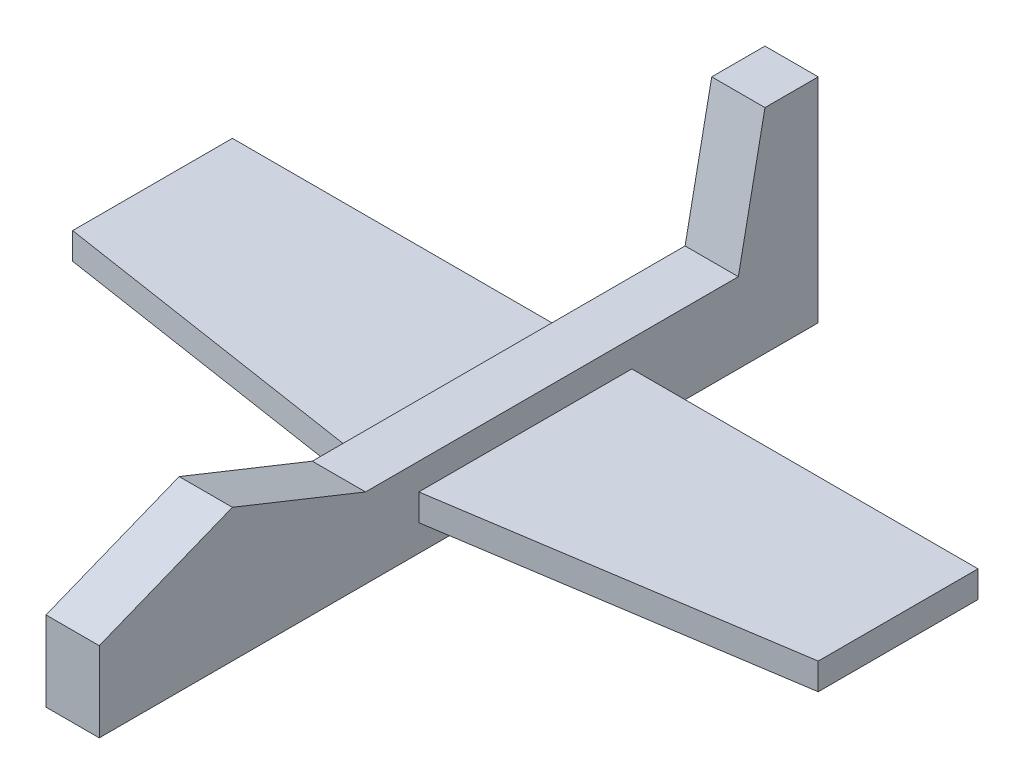
ISO-10303-21;
HEADER;
FILE_DESCRIPTION(('STEP AP214'),'2;1');
FILE_NAME('part.step','',(''),(''),'','','');
FILE_SCHEMA(('AUTOMOTIVE_DESIGN { 1 0 10303 214 1 1 1 1 }'));
ENDSEC;
DATA;
#1=APPLICATION_CONTEXT('core data for automotive mechanical design processes');
#2=APPLICATION_PROTOCOL_DEFINITION('international standard','automotive_design',2000,#1);
#3=PRODUCT_CONTEXT('',#1,'mechanical');
#4=PRODUCT('Part','Part','',(#3));
#5=PRODUCT_RELATED_PRODUCT_CATEGORY('part','',(#4));
#6=PRODUCT_DEFINITION_FORMATION('','',#4);
#7=PRODUCT_DEFINITION_CONTEXT('part definition',#1,'design');
#8=PRODUCT_DEFINITION('design','',#6,#7);
#9=PRODUCT_DEFINITION_SHAPE('','',#8);
#10=(LENGTH_UNIT() NAMED_UNIT(*) SI_UNIT(.MILLI.,.METRE.));
#11=(NAMED_UNIT(*) PLANE_ANGLE_UNIT() SI_UNIT($,.RADIAN.));
#12=(NAMED_UNIT(*) SI_UNIT($,.STERADIAN.) SOLID_ANGLE_UNIT());
#13=UNCERTAINTY_MEASURE_WITH_UNIT(LENGTH_MEASURE(1.E-05),#10,'distance_accuracy_value','');
#14=(GEOMETRIC_REPRESENTATION_CONTEXT(3) GLOBAL_UNCERTAINTY_ASSIGNED_CONTEXT((#13)) GLOBAL_UNIT_ASSIGNED_CONTEXT((#10,
#11,#12)) REPRESENTATION_CONTEXT('',''));
#15=CARTESIAN_POINT('',(0.,0.,0.));
#16=DIRECTION('',(0.,0.,1.));
#17=DIRECTION('',(1.,0.,0.));
#18=AXIS2_PLACEMENT_3D('',#15,#16,#17);
#19=CARTESIAN_POINT('',(-5.,0.,0.));
#20=DIRECTION('',(-1.,0.,0.));
#21=DIRECTION('',(0.,0.,1.));
#22=AXIS2_PLACEMENT_3D('',#19,#20,#21);
#23=PLANE('',#22);
#24=DIRECTION('',(0.,1.,0.));
#25=VECTOR('',#24,1.);
#26=CARTESIAN_POINT('',(-5.,0.,0.));
#27=LINE('',#26,#25);
#28=CARTESIAN_POINT('',(-5.,0.,0.));
#29=VERTEX_POINT('',#28);
#30=CARTESIAN_POINT('',(-5.,15.,0.));
#31=VERTEX_POINT('',#30);
#32=EDGE_CURVE('E236',#29,#31,#27,.T.);
#33=ORIENTED_EDGE('',*,*,#32,.T.);
#34=DIRECTION('',(0.,0.371390676354104,-0.928476690885259));
#35=VECTOR('',#34,1.);
#36=CARTESIAN_POINT('',(-5.,15.,0.));
#37=LINE('',#36,#35);
#38=CARTESIAN_POINT('',(-5.,25.,-25.));
#39=VERTEX_POINT('',#38);
#40=EDGE_CURVE('E239',#31,#39,#37,.T.);
#41=ORIENTED_EDGE('',*,*,#40,.T.);
#42=DIRECTION('',(0.,-0.371390676354104,-0.928476690885259));
#43=VECTOR('',#42,1.);
#44=CARTESIAN_POINT('',(-5.,25.,-25.));
#45=LINE('',#44,#43);
#46=CARTESIAN_POINT('',(-5.,15.,-50.));
#47=VERTEX_POINT('',#46);
#48=EDGE_CURVE('E241',#39,#47,#45,.T.);
#49=ORIENTED_EDGE('',*,*,#48,.T.);
#50=DIRECTION('',(0.,0.,-1.));
#51=VECTOR('',#50,1.);
#52=CARTESIAN_POINT('',(-5.,15.,-50.));
#53=LINE('',#52,#51);
#54=CARTESIAN_POINT('',(-5.,15.,-120.));
#55=VERTEX_POINT('',#54);
#56=EDGE_CURVE('E243',#47,#55,#53,.T.);
#57=ORIENTED_EDGE('',*,*,#56,.T.);
#58=DIRECTION('',(0.,0.98058067569092,-0.196116135138184));
#59=VECTOR('',#58,1.);
#60=CARTESIAN_POINT('',(-5.,15.,-120.));
#61=LINE('',#60,#59);
#62=CARTESIAN_POINT('',(-5.,40.,-125.));
#63=VERTEX_POINT('',#62);
#64=EDGE_CURVE('E245',#55,#63,#61,.T.);
#65=ORIENTED_EDGE('',*,*,#64,.T.);
#66=DIRECTION('',(0.,0.,-1.));
#67=VECTOR('',#66,1.);
#68=CARTESIAN_POINT('',(-5.,40.,-125.));
#69=LINE('',#68,#67);
#70=CARTESIAN_POINT('',(-5.,40.,-135.));
#71=VERTEX_POINT('',#70);
#72=EDGE_CURVE('E247',#63,#71,#69,.T.);
#73=ORIENTED_EDGE('',*,*,#72,.T.);
#74=DIRECTION('',(0.,-1.,0.));
#75=VECTOR('',#74,1.);
#76=CARTESIAN_POINT('',(-5.,40.,-135.));
#77=LINE('',#76,#75);
#78=CARTESIAN_POINT('',(-5.,0.,-135.));
#79=VERTEX_POINT('',#78);
#80=EDGE_CURVE('E249',#71,#79,#77,.T.);
#81=ORIENTED_EDGE('',*,*,#80,.T.);
#82=DIRECTION('',(0.,0.,1.));
#83=VECTOR('',#82,1.);
#84=CARTESIAN_POINT('',(-5.,0.,-135.));
#85=LINE('',#84,#83);
#86=EDGE_CURVE('E251',#79,#29,#85,.T.);
#87=ORIENTED_EDGE('',*,*,#86,.T.);
#88=EDGE_LOOP('',(#33,#41,#49,#57,#65,#73,#81,#87));
#89=FACE_BOUND('',#88,.T.);
#90=DIRECTION('',(0.,-1.,0.));
#91=VECTOR('',#90,1.);
#92=CARTESIAN_POINT('',(-5.,10.,-100.));
#93=LINE('',#92,#91);
#94=CARTESIAN_POINT('',(-5.,10.,-100.));
#95=VERTEX_POINT('',#94);
#96=CARTESIAN_POINT('',(-5.,5.,-100.));
#97=VERTEX_POINT('',#96);
#98=EDGE_CURVE('E50',#95,#97,#93,.T.);
#99=ORIENTED_EDGE('',*,*,#98,.F.);
#100=DIRECTION('',(0.,0.,1.));
#101=VECTOR('',#100,1.);
#102=CARTESIAN_POINT('',(-5.,10.,-100.));
#103=LINE('',#102,#101);
#104=CARTESIAN_POINT('',(-5.,10.,-60.));
#105=VERTEX_POINT('',#104);
#106=EDGE_CURVE('E54',#95,#105,#103,.T.);
#107=ORIENTED_EDGE('',*,*,#106,.T.);
#108=DIRECTION('',(0.,-1.,0.));
#109=VECTOR('',#108,1.);
#110=CARTESIAN_POINT('',(-5.,10.,-60.));
#111=LINE('',#110,#109);
#112=CARTESIAN_POINT('',(-5.,5.,-60.));
#113=VERTEX_POINT('',#112);
#114=EDGE_CURVE('E167',#105,#113,#111,.T.);
#115=ORIENTED_EDGE('',*,*,#114,.T.);
#116=DIRECTION('',(0.,0.,1.));
#117=VECTOR('',#116,1.);
#118=CARTESIAN_POINT('',(-5.,5.,-100.));
#119=LINE('',#118,#117);
#120=EDGE_CURVE('E171',#97,#113,#119,.T.);
#121=ORIENTED_EDGE('',*,*,#120,.F.);
#122=EDGE_LOOP('',(#99,#107,#115,#121));
#123=FACE_BOUND('',#122,.T.);
#124=ADVANCED_FACE('F35',(#89,#123),#23,.T.);
#125=CARTESIAN_POINT('',(5.,0.,0.));
#126=DIRECTION('',(-1.,0.,0.));
#127=DIRECTION('',(0.,0.,1.));
#128=AXIS2_PLACEMENT_3D('',#125,#126,#127);
#129=PLANE('',#128);
#130=DIRECTION('',(0.,1.,0.));
#131=VECTOR('',#130,1.);
#132=CARTESIAN_POINT('',(5.,0.,0.));
#133=LINE('',#132,#131);
#134=CARTESIAN_POINT('',(5.,0.,0.));
#135=VERTEX_POINT('',#134);
#136=CARTESIAN_POINT('',(5.,15.,0.));
#137=VERTEX_POINT('',#136);
#138=EDGE_CURVE('E212',#135,#137,#133,.T.);
#139=ORIENTED_EDGE('',*,*,#138,.F.);
#140=DIRECTION('',(0.,0.,1.));
#141=VECTOR('',#140,1.);
#142=CARTESIAN_POINT('',(5.,0.,-135.));
#143=LINE('',#142,#141);
#144=CARTESIAN_POINT('',(5.,0.,-135.));
#145=VERTEX_POINT('',#144);
#146=EDGE_CURVE('E233',#145,#135,#143,.T.);
#147=ORIENTED_EDGE('',*,*,#146,.F.);
#148=DIRECTION('',(0.,-1.,0.));
#149=VECTOR('',#148,1.);
#150=CARTESIAN_POINT('',(5.,40.,-135.));
#151=LINE('',#150,#149);
#152=CARTESIAN_POINT('',(5.,40.,-135.));
#153=VERTEX_POINT('',#152);
#154=EDGE_CURVE('E230',#153,#145,#151,.T.);
#155=ORIENTED_EDGE('',*,*,#154,.F.);
#156=DIRECTION('',(0.,0.,-1.));
#157=VECTOR('',#156,1.);
#158=CARTESIAN_POINT('',(5.,40.,-125.));
#159=LINE('',#158,#157);
#160=CARTESIAN_POINT('',(5.,40.,-125.));
#161=VERTEX_POINT('',#160);
#162=EDGE_CURVE('E227',#161,#153,#159,.T.);
#163=ORIENTED_EDGE('',*,*,#162,.F.);
#164=DIRECTION('',(0.,0.98058067569092,-0.196116135138184));
#165=VECTOR('',#164,1.);
#166=CARTESIAN_POINT('',(5.,15.,-120.));
#167=LINE('',#166,#165);
#168=CARTESIAN_POINT('',(5.,15.,-120.));
#169=VERTEX_POINT('',#168);
#170=EDGE_CURVE('E224',#169,#161,#167,.T.);
#171=ORIENTED_EDGE('',*,*,#170,.F.);
#172=DIRECTION('',(0.,0.,-1.));
#173=VECTOR('',#172,1.);
#174=CARTESIAN_POINT('',(5.,15.,-50.));
#175=LINE('',#174,#173);
#176=CARTESIAN_POINT('',(5.,15.,-50.));
#177=VERTEX_POINT('',#176);
#178=EDGE_CURVE('E221',#177,#169,#175,.T.);
#179=ORIENTED_EDGE('',*,*,#178,.F.);
#180=DIRECTION('',(0.,-0.371390676354104,-0.928476690885259));
#181=VECTOR('',#180,1.);
#182=CARTESIAN_POINT('',(5.,25.,-25.));
#183=LINE('',#182,#181);
#184=CARTESIAN_POINT('',(5.,25.,-25.));
#185=VERTEX_POINT('',#184);
#186=EDGE_CURVE('E218',#185,#177,#183,.T.);
#187=ORIENTED_EDGE('',*,*,#186,.F.);
#188=DIRECTION('',(0.,0.371390676354104,-0.928476690885259));
#189=VECTOR('',#188,1.);
#190=CARTESIAN_POINT('',(5.,15.,0.));
#191=LINE('',#190,#189);
#192=EDGE_CURVE('E215',#137,#185,#191,.T.);
#193=ORIENTED_EDGE('',*,*,#192,.F.);
#194=EDGE_LOOP('',(#139,#147,#155,#163,#171,#179,#187,#193));
#195=FACE_BOUND('',#194,.T.);
#196=DIRECTION('',(0.,0.,1.));
#197=VECTOR('',#196,1.);
#198=CARTESIAN_POINT('',(5.,10.,-100.));
#199=LINE('',#198,#197);
#200=CARTESIAN_POINT('',(5.,10.,-100.));
#201=VERTEX_POINT('',#200);
#202=CARTESIAN_POINT('',(5.,10.,-60.));
#203=VERTEX_POINT('',#202);
#204=EDGE_CURVE('E184',#201,#203,#199,.T.);
#205=ORIENTED_EDGE('',*,*,#204,.F.);
#206=DIRECTION('',(0.,-1.,0.));
#207=VECTOR('',#206,1.);
#208=CARTESIAN_POINT('',(5.,10.,-100.));
#209=LINE('',#208,#207);
#210=CARTESIAN_POINT('',(5.,5.,-100.));
#211=VERTEX_POINT('',#210);
#212=EDGE_CURVE('E194',#201,#211,#209,.T.);
#213=ORIENTED_EDGE('',*,*,#212,.T.);
#214=DIRECTION('',(0.,0.,1.));
#215=VECTOR('',#214,1.);
#216=CARTESIAN_POINT('',(5.,5.,-100.));
#217=LINE('',#216,#215);
#218=CARTESIAN_POINT('',(5.,5.,-60.));
#219=VERTEX_POINT('',#218);
#220=EDGE_CURVE('E183',#211,#219,#217,.T.);
#221=ORIENTED_EDGE('',*,*,#220,.T.);
#222=DIRECTION('',(0.,-1.,0.));
#223=VECTOR('',#222,1.);
#224=CARTESIAN_POINT('',(5.,10.,-60.));
#225=LINE('',#224,#223);
#226=EDGE_CURVE('E210',#203,#219,#225,.T.);
#227=ORIENTED_EDGE('',*,*,#226,.F.);
#228=EDGE_LOOP('',(#205,#213,#221,#227));
#229=FACE_BOUND('',#228,.T.);
#230=ADVANCED_FACE('F275',(#195,#229),#129,.F.);
#231=CARTESIAN_POINT('',(-5.,0.,0.));
#232=DIRECTION('',(0.,0.,-1.));
#233=DIRECTION('',(-1.,0.,0.));
#234=AXIS2_PLACEMENT_3D('',#231,#232,#233);
#235=PLANE('',#234);
#236=DIRECTION('',(1.,0.,0.));
#237=VECTOR('',#236,1.);
#238=CARTESIAN_POINT('',(-5.,0.,0.));
#239=LINE('',#238,#237);
#240=EDGE_CURVE('E253',#29,#135,#239,.T.);
#241=ORIENTED_EDGE('',*,*,#240,.T.);
#242=ORIENTED_EDGE('',*,*,#138,.T.);
#243=DIRECTION('',(1.,0.,0.));
#244=VECTOR('',#243,1.);
#245=CARTESIAN_POINT('',(-5.,15.,0.));
#246=LINE('',#245,#244);
#247=EDGE_CURVE('E11',#31,#137,#246,.T.);
#248=ORIENTED_EDGE('',*,*,#247,.F.);
#249=ORIENTED_EDGE('',*,*,#32,.F.);
#250=EDGE_LOOP('',(#241,#242,#248,#249));
#251=FACE_BOUND('',#250,.T.);
#252=ADVANCED_FACE('F37',(#251),#235,.F.);
#253=CARTESIAN_POINT('',(-5.,15.,0.));
#254=DIRECTION('',(0.,-0.928476690885259,-0.371390676354104));
#255=DIRECTION('',(0.,0.371390676354104,-0.928476690885259));
#256=AXIS2_PLACEMENT_3D('',#253,#254,#255);
#257=PLANE('',#256);
#258=ORIENTED_EDGE('',*,*,#247,.T.);
#259=ORIENTED_EDGE('',*,*,#192,.T.);
#260=DIRECTION('',(1.,0.,0.));
#261=VECTOR('',#260,1.);
#262=CARTESIAN_POINT('',(-5.,25.,-25.));
#263=LINE('',#262,#261);
#264=EDGE_CURVE('E43',#39,#185,#263,.T.);
#265=ORIENTED_EDGE('',*,*,#264,.F.);
#266=ORIENTED_EDGE('',*,*,#40,.F.);
#267=EDGE_LOOP('',(#258,#259,#265,#266));
#268=FACE_BOUND('',#267,.T.);
#269=ADVANCED_FACE('F278',(#268),#257,.F.);
#270=CARTESIAN_POINT('',(-5.,25.,-25.));
#271=DIRECTION('',(0.,-0.928476690885259,0.371390676354104));
#272=DIRECTION('',(0.,-0.371390676354104,-0.928476690885259));
#273=AXIS2_PLACEMENT_3D('',#270,#271,#272);
#274=PLANE('',#273);
#275=ORIENTED_EDGE('',*,*,#264,.T.);
#276=ORIENTED_EDGE('',*,*,#186,.T.);
#277=DIRECTION('',(1.,0.,0.));
#278=VECTOR('',#277,1.);
#279=CARTESIAN_POINT('',(-5.,15.,-50.));
#280=LINE('',#279,#278);
#281=EDGE_CURVE('E263',#47,#177,#280,.T.);
#282=ORIENTED_EDGE('',*,*,#281,.F.);
#283=ORIENTED_EDGE('',*,*,#48,.F.);
#284=EDGE_LOOP('',(#275,#276,#282,#283));
#285=FACE_BOUND('',#284,.T.);
#286=ADVANCED_FACE('F268',(#285),#274,.F.);
#287=CARTESIAN_POINT('',(-5.,15.,-50.));
#288=DIRECTION('',(0.,-1.,0.));
#289=DIRECTION('',(0.,0.,-1.));
#290=AXIS2_PLACEMENT_3D('',#287,#288,#289);
#291=PLANE('',#290);
#292=ORIENTED_EDGE('',*,*,#281,.T.);
#293=ORIENTED_EDGE('',*,*,#178,.T.);
#294=DIRECTION('',(1.,0.,0.));
#295=VECTOR('',#294,1.);
#296=CARTESIAN_POINT('',(-5.,15.,-120.));
#297=LINE('',#296,#295);
#298=EDGE_CURVE('E261',#55,#169,#297,.T.);
#299=ORIENTED_EDGE('',*,*,#298,.F.);
#300=ORIENTED_EDGE('',*,*,#56,.F.);
#301=EDGE_LOOP('',(#292,#293,#299,#300));
#302=FACE_BOUND('',#301,.T.);
#303=ADVANCED_FACE('F303',(#302),#291,.F.);
#304=CARTESIAN_POINT('',(-5.,15.,-120.));
#305=DIRECTION('',(0.,-0.196116135138184,-0.98058067569092));
#306=DIRECTION('',(0.,0.98058067569092,-0.196116135138184));
#307=AXIS2_PLACEMENT_3D('',#304,#305,#306);
#308=PLANE('',#307);
#309=ORIENTED_EDGE('',*,*,#298,.T.);
#310=ORIENTED_EDGE('',*,*,#170,.T.);
#311=DIRECTION('',(1.,0.,0.));
#312=VECTOR('',#311,1.);
#313=CARTESIAN_POINT('',(-5.,40.,-125.));
#314=LINE('',#313,#312);
#315=EDGE_CURVE('E259',#63,#161,#314,.T.);
#316=ORIENTED_EDGE('',*,*,#315,.F.);
#317=ORIENTED_EDGE('',*,*,#64,.F.);
#318=EDGE_LOOP('',(#309,#310,#316,#317));
#319=FACE_BOUND('',#318,.T.);
#320=ADVANCED_FACE('F300',(#319),#308,.F.);
#321=CARTESIAN_POINT('',(-5.,40.,-125.));
#322=DIRECTION('',(0.,-1.,0.));
#323=DIRECTION('',(0.,0.,-1.));
#324=AXIS2_PLACEMENT_3D('',#321,#322,#323);
#325=PLANE('',#324);
#326=ORIENTED_EDGE('',*,*,#315,.T.);
#327=ORIENTED_EDGE('',*,*,#162,.T.);
#328=DIRECTION('',(1.,0.,0.));
#329=VECTOR('',#328,1.);
#330=CARTESIAN_POINT('',(-5.,40.,-135.));
#331=LINE('',#330,#329);
#332=EDGE_CURVE('E257',#71,#153,#331,.T.);
#333=ORIENTED_EDGE('',*,*,#332,.F.);
#334=ORIENTED_EDGE('',*,*,#72,.F.);
#335=EDGE_LOOP('',(#326,#327,#333,#334));
#336=FACE_BOUND('',#335,.T.);
#337=ADVANCED_FACE('F295',(#336),#325,.F.);
#338=CARTESIAN_POINT('',(-5.,40.,-135.));
#339=DIRECTION('',(0.,0.,1.));
#340=DIRECTION('',(1.,0.,0.));
#341=AXIS2_PLACEMENT_3D('',#338,#339,#340);
#342=PLANE('',#341);
#343=ORIENTED_EDGE('',*,*,#332,.T.);
#344=ORIENTED_EDGE('',*,*,#154,.T.);
#345=DIRECTION('',(1.,0.,0.));
#346=VECTOR('',#345,1.);
#347=CARTESIAN_POINT('',(-5.,0.,-135.));
#348=LINE('',#347,#346);
#349=EDGE_CURVE('E255',#79,#145,#348,.T.);
#350=ORIENTED_EDGE('',*,*,#349,.F.);
#351=ORIENTED_EDGE('',*,*,#80,.F.);
#352=EDGE_LOOP('',(#343,#344,#350,#351));
#353=FACE_BOUND('',#352,.T.);
#354=ADVANCED_FACE('F291',(#353),#342,.F.);
#355=CARTESIAN_POINT('',(-5.,0.,-135.));
#356=DIRECTION('',(0.,1.,0.));
#357=DIRECTION('',(0.,0.,1.));
#358=AXIS2_PLACEMENT_3D('',#355,#356,#357);
#359=PLANE('',#358);
#360=ORIENTED_EDGE('',*,*,#349,.T.);
#361=ORIENTED_EDGE('',*,*,#146,.T.);
#362=ORIENTED_EDGE('',*,*,#240,.F.);
#363=ORIENTED_EDGE('',*,*,#86,.F.);
#364=EDGE_LOOP('',(#360,#361,#362,#363));
#365=FACE_BOUND('',#364,.T.);
#366=ADVANCED_FACE('F286',(#365),#359,.F.);
#367=CARTESIAN_POINT('',(5.,10.,-60.));
#368=DIRECTION('',(-0.152057184253941,0.,-0.988371697650617));
#369=DIRECTION('',(-0.988371697650617,0.,0.152057184253941));
#370=AXIS2_PLACEMENT_3D('',#367,#368,#369);
#371=PLANE('',#370);
#372=DIRECTION('',(0.988371697650617,0.,-0.152057184253941));
#373=VECTOR('',#372,1.);
#374=CARTESIAN_POINT('',(5.,5.,-60.));
#375=LINE('',#374,#373);
#376=CARTESIAN_POINT('',(70.,5.,-70.));
#377=VERTEX_POINT('',#376);
#378=EDGE_CURVE('E197',#219,#377,#375,.T.);
#379=ORIENTED_EDGE('',*,*,#378,.T.);
#380=DIRECTION('',(0.,-1.,0.));
#381=VECTOR('',#380,1.);
#382=CARTESIAN_POINT('',(70.,10.,-70.));
#383=LINE('',#382,#381);
#384=CARTESIAN_POINT('',(70.,10.,-70.));
#385=VERTEX_POINT('',#384);
#386=EDGE_CURVE('E207',#385,#377,#383,.T.);
#387=ORIENTED_EDGE('',*,*,#386,.F.);
#388=DIRECTION('',(0.988371697650617,0.,-0.152057184253941));
#389=VECTOR('',#388,1.);
#390=CARTESIAN_POINT('',(5.,10.,-60.));
#391=LINE('',#390,#389);
#392=EDGE_CURVE('E187',#203,#385,#391,.T.);
#393=ORIENTED_EDGE('',*,*,#392,.F.);
#394=ORIENTED_EDGE('',*,*,#226,.T.);
#395=EDGE_LOOP('',(#379,#387,#393,#394));
#396=FACE_BOUND('',#395,.T.);
#397=ADVANCED_FACE('F316',(#396),#371,.F.);
#398=CARTESIAN_POINT('',(70.,10.,-70.));
#399=DIRECTION('',(-1.,0.,0.));
#400=DIRECTION('',(0.,0.,1.));
#401=AXIS2_PLACEMENT_3D('',#398,#399,#400);
#402=PLANE('',#401);
#403=DIRECTION('',(0.,0.,-1.));
#404=VECTOR('',#403,1.);
#405=CARTESIAN_POINT('',(70.,5.,-70.));
#406=LINE('',#405,#404);
#407=CARTESIAN_POINT('',(70.,5.,-100.));
#408=VERTEX_POINT('',#407);
#409=EDGE_CURVE('E199',#377,#408,#406,.T.);
#410=ORIENTED_EDGE('',*,*,#409,.T.);
#411=DIRECTION('',(0.,-1.,0.));
#412=VECTOR('',#411,1.);
#413=CARTESIAN_POINT('',(70.,10.,-100.));
#414=LINE('',#413,#412);
#415=CARTESIAN_POINT('',(70.,10.,-100.));
#416=VERTEX_POINT('',#415);
#417=EDGE_CURVE('E204',#416,#408,#414,.T.);
#418=ORIENTED_EDGE('',*,*,#417,.F.);
#419=DIRECTION('',(0.,0.,-1.));
#420=VECTOR('',#419,1.);
#421=CARTESIAN_POINT('',(70.,10.,-70.));
#422=LINE('',#421,#420);
#423=EDGE_CURVE('E190',#385,#416,#422,.T.);
#424=ORIENTED_EDGE('',*,*,#423,.F.);
#425=ORIENTED_EDGE('',*,*,#386,.T.);
#426=EDGE_LOOP('',(#410,#418,#424,#425));
#427=FACE_BOUND('',#426,.T.);
#428=ADVANCED_FACE('F424',(#427),#402,.F.);
#429=CARTESIAN_POINT('',(70.,10.,-100.));
#430=DIRECTION('',(0.,0.,1.));
#431=DIRECTION('',(1.,0.,0.));
#432=AXIS2_PLACEMENT_3D('',#429,#430,#431);
#433=PLANE('',#432);
#434=DIRECTION('',(-1.,0.,0.));
#435=VECTOR('',#434,1.);
#436=CARTESIAN_POINT('',(70.,5.,-100.));
#437=LINE('',#436,#435);
#438=EDGE_CURVE('E188',#408,#211,#437,.T.);
#439=ORIENTED_EDGE('',*,*,#438,.T.);
#440=ORIENTED_EDGE('',*,*,#212,.F.);
#441=DIRECTION('',(-1.,0.,0.));
#442=VECTOR('',#441,1.);
#443=CARTESIAN_POINT('',(70.,10.,-100.));
#444=LINE('',#443,#442);
#445=EDGE_CURVE('E192',#416,#201,#444,.T.);
#446=ORIENTED_EDGE('',*,*,#445,.F.);
#447=ORIENTED_EDGE('',*,*,#417,.T.);
#448=EDGE_LOOP('',(#439,#440,#446,#447));
#449=FACE_BOUND('',#448,.T.);
#450=ADVANCED_FACE('F415',(#449),#433,.F.);
#451=CARTESIAN_POINT('',(0.,10.,0.));
#452=DIRECTION('',(0.,-1.,0.));
#453=DIRECTION('',(0.,0.,-1.));
#454=AXIS2_PLACEMENT_3D('',#451,#452,#453);
#455=PLANE('',#454);
#456=ORIENTED_EDGE('',*,*,#204,.T.);
#457=ORIENTED_EDGE('',*,*,#392,.T.);
#458=ORIENTED_EDGE('',*,*,#423,.T.);
#459=ORIENTED_EDGE('',*,*,#445,.T.);
#460=EDGE_LOOP('',(#456,#457,#458,#459));
#461=FACE_BOUND('',#460,.T.);
#462=ADVANCED_FACE('F345',(#461),#455,.F.);
#463=CARTESIAN_POINT('',(0.,5.,0.));
#464=DIRECTION('',(0.,-1.,0.));
#465=DIRECTION('',(0.,0.,-1.));
#466=AXIS2_PLACEMENT_3D('',#463,#464,#465);
#467=PLANE('',#466);
#468=ORIENTED_EDGE('',*,*,#220,.F.);
#469=ORIENTED_EDGE('',*,*,#438,.F.);
#470=ORIENTED_EDGE('',*,*,#409,.F.);
#471=ORIENTED_EDGE('',*,*,#378,.F.);
#472=EDGE_LOOP('',(#468,#469,#470,#471));
#473=FACE_BOUND('',#472,.T.);
#474=ADVANCED_FACE('F397',(#473),#467,.T.);
#475=CARTESIAN_POINT('',(-70.,10.,-100.));
#476=DIRECTION('',(0.,0.,-1.));
#477=DIRECTION('',(-1.,0.,0.));
#478=AXIS2_PLACEMENT_3D('',#475,#476,#477);
#479=PLANE('',#478);
#480=DIRECTION('',(1.,0.,0.));
#481=VECTOR('',#480,1.);
#482=CARTESIAN_POINT('',(-70.,5.,-100.));
#483=LINE('',#482,#481);
#484=CARTESIAN_POINT('',(-70.,5.,-100.));
#485=VERTEX_POINT('',#484);
#486=EDGE_CURVE('E150',#485,#97,#483,.T.);
#487=ORIENTED_EDGE('',*,*,#486,.F.);
#488=DIRECTION('',(0.,-1.,0.));
#489=VECTOR('',#488,1.);
#490=CARTESIAN_POINT('',(-70.,10.,-100.));
#491=LINE('',#490,#489);
#492=CARTESIAN_POINT('',(-70.,10.,-100.));
#493=VERTEX_POINT('',#492);
#494=EDGE_CURVE('E145',#493,#485,#491,.T.);
#495=ORIENTED_EDGE('',*,*,#494,.F.);
#496=DIRECTION('',(1.,0.,0.));
#497=VECTOR('',#496,1.);
#498=CARTESIAN_POINT('',(-70.,10.,-100.));
#499=LINE('',#498,#497);
#500=EDGE_CURVE('E148',#493,#95,#499,.T.);
#501=ORIENTED_EDGE('',*,*,#500,.T.);
#502=ORIENTED_EDGE('',*,*,#98,.T.);
#503=EDGE_LOOP('',(#487,#495,#501,#502));
#504=FACE_BOUND('',#503,.T.);
#505=ADVANCED_FACE('F147',(#504),#479,.T.);
#506=CARTESIAN_POINT('',(-70.,10.,-70.));
#507=DIRECTION('',(-1.,0.,0.));
#508=DIRECTION('',(0.,0.,1.));
#509=AXIS2_PLACEMENT_3D('',#506,#507,#508);
#510=PLANE('',#509);
#511=DIRECTION('',(0.,0.,-1.));
#512=VECTOR('',#511,1.);
#513=CARTESIAN_POINT('',(-70.,5.,-70.));
#514=LINE('',#513,#512);
#515=CARTESIAN_POINT('',(-70.,5.,-70.));
#516=VERTEX_POINT('',#515);
#517=EDGE_CURVE('E175',#516,#485,#514,.T.);
#518=ORIENTED_EDGE('',*,*,#517,.F.);
#519=DIRECTION('',(0.,-1.,0.));
#520=VECTOR('',#519,1.);
#521=CARTESIAN_POINT('',(-70.,10.,-70.));
#522=LINE('',#521,#520);
#523=CARTESIAN_POINT('',(-70.,10.,-70.));
#524=VERTEX_POINT('',#523);
#525=EDGE_CURVE('E155',#524,#516,#522,.T.);
#526=ORIENTED_EDGE('',*,*,#525,.F.);
#527=DIRECTION('',(0.,0.,-1.));
#528=VECTOR('',#527,1.);
#529=CARTESIAN_POINT('',(-70.,10.,-70.));
#530=LINE('',#529,#528);
#531=EDGE_CURVE('E161',#524,#493,#530,.T.);
#532=ORIENTED_EDGE('',*,*,#531,.T.);
#533=ORIENTED_EDGE('',*,*,#494,.T.);
#534=EDGE_LOOP('',(#518,#526,#532,#533));
#535=FACE_BOUND('',#534,.T.);
#536=ADVANCED_FACE('F164',(#535),#510,.T.);
#537=CARTESIAN_POINT('',(-5.,10.,-60.));
#538=DIRECTION('',(-0.152057184253941,0.,0.988371697650617));
#539=DIRECTION('',(0.988371697650617,0.,0.152057184253941));
#540=AXIS2_PLACEMENT_3D('',#537,#538,#539);
#541=PLANE('',#540);
#542=DIRECTION('',(-0.988371697650617,0.,-0.152057184253941));
#543=VECTOR('',#542,1.);
#544=CARTESIAN_POINT('',(-5.,5.,-60.));
#545=LINE('',#544,#543);
#546=EDGE_CURVE('E177',#113,#516,#545,.T.);
#547=ORIENTED_EDGE('',*,*,#546,.F.);
#548=ORIENTED_EDGE('',*,*,#114,.F.);
#549=DIRECTION('',(-0.988371697650617,0.,-0.152057184253941));
#550=VECTOR('',#549,1.);
#551=CARTESIAN_POINT('',(-5.,10.,-60.));
#552=LINE('',#551,#550);
#553=EDGE_CURVE('E165',#105,#524,#552,.T.);
#554=ORIENTED_EDGE('',*,*,#553,.T.);
#555=ORIENTED_EDGE('',*,*,#525,.T.);
#556=EDGE_LOOP('',(#547,#548,#554,#555));
#557=FACE_BOUND('',#556,.T.);
#558=ADVANCED_FACE('F354',(#557),#541,.T.);
#559=CARTESIAN_POINT('',(0.,10.,0.));
#560=DIRECTION('',(0.,-1.,0.));
#561=DIRECTION('',(0.,0.,-1.));
#562=AXIS2_PLACEMENT_3D('',#559,#560,#561);
#563=PLANE('',#562);
#564=ORIENTED_EDGE('',*,*,#106,.F.);
#565=ORIENTED_EDGE('',*,*,#500,.F.);
#566=ORIENTED_EDGE('',*,*,#531,.F.);
#567=ORIENTED_EDGE('',*,*,#553,.F.);
#568=EDGE_LOOP('',(#564,#565,#566,#567));
#569=FACE_BOUND('',#568,.T.);
#570=ADVANCED_FACE('F159',(#569),#563,.F.);
#571=CARTESIAN_POINT('',(0.,5.,0.));
#572=DIRECTION('',(0.,-1.,0.));
#573=DIRECTION('',(0.,0.,-1.));
#574=AXIS2_PLACEMENT_3D('',#571,#572,#573);
#575=PLANE('',#574);
#576=ORIENTED_EDGE('',*,*,#120,.T.);
#577=ORIENTED_EDGE('',*,*,#546,.T.);
#578=ORIENTED_EDGE('',*,*,#517,.T.);
#579=ORIENTED_EDGE('',*,*,#486,.T.);
#580=EDGE_LOOP('',(#576,#577,#578,#579));
#581=FACE_BOUND('',#580,.T.);
#582=ADVANCED_FACE('F373',(#581),#575,.T.);
#583=CLOSED_SHELL('',(#124,#230,#252,#269,#286,#303,#320,#337,#354,#366,#397,#428,#450,#462,
#474,#505,#536,#558,#570,#582));
#584=MANIFOLD_SOLID_BREP('B2',#583);
#585=ADVANCED_BREP_SHAPE_REPRESENTATION('',(#18,#584),#14);
#586=SHAPE_DEFINITION_REPRESENTATION(#9,#585);
ENDSEC;
END-ISO-10303-21;
